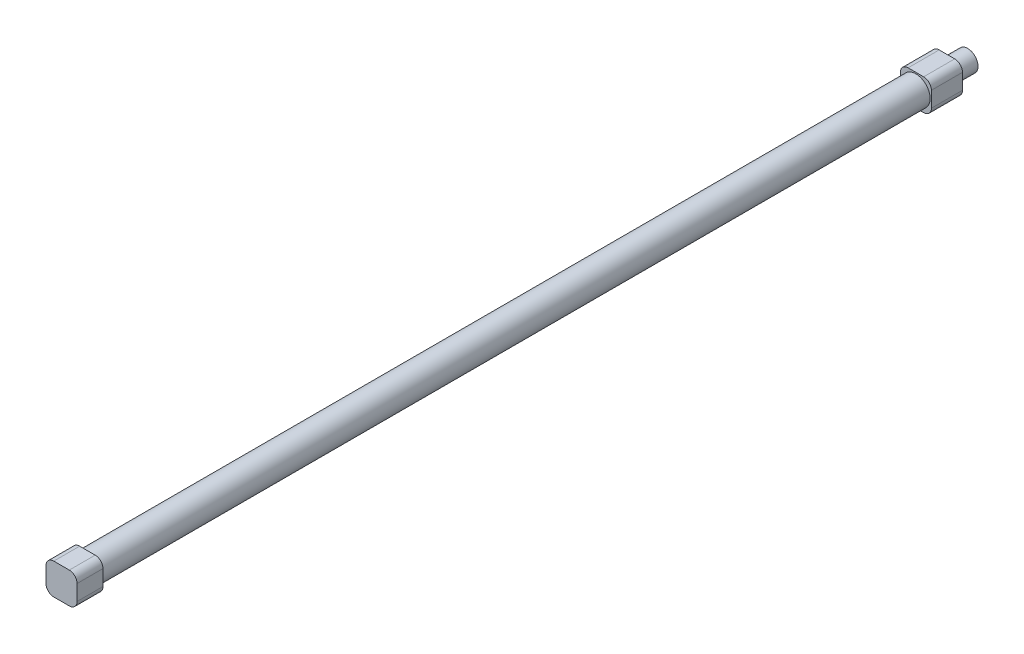
ISO-10303-21;
HEADER;
FILE_DESCRIPTION(('STEP AP214'),'2;1');
FILE_NAME('part.step','',(''),(''),'','','');
FILE_SCHEMA(('AUTOMOTIVE_DESIGN { 1 0 10303 214 1 1 1 1 }'));
ENDSEC;
DATA;
#1=APPLICATION_CONTEXT('core data for automotive mechanical design processes');
#2=APPLICATION_PROTOCOL_DEFINITION('international standard','automotive_design',2000,#1);
#3=PRODUCT_CONTEXT('',#1,'mechanical');
#4=PRODUCT('Part','Part','',(#3));
#5=PRODUCT_RELATED_PRODUCT_CATEGORY('part','',(#4));
#6=PRODUCT_DEFINITION_FORMATION('','',#4);
#7=PRODUCT_DEFINITION_CONTEXT('part definition',#1,'design');
#8=PRODUCT_DEFINITION('design','',#6,#7);
#9=PRODUCT_DEFINITION_SHAPE('','',#8);
#10=(LENGTH_UNIT() NAMED_UNIT(*) SI_UNIT(.MILLI.,.METRE.));
#11=(NAMED_UNIT(*) PLANE_ANGLE_UNIT() SI_UNIT($,.RADIAN.));
#12=(NAMED_UNIT(*) SI_UNIT($,.STERADIAN.) SOLID_ANGLE_UNIT());
#13=UNCERTAINTY_MEASURE_WITH_UNIT(LENGTH_MEASURE(1.E-05),#10,'distance_accuracy_value','');
#14=(GEOMETRIC_REPRESENTATION_CONTEXT(3) GLOBAL_UNCERTAINTY_ASSIGNED_CONTEXT((#13)) GLOBAL_UNIT_ASSIGNED_CONTEXT((#10,
#11,#12)) REPRESENTATION_CONTEXT('',''));
#15=CARTESIAN_POINT('',(0.,0.,0.));
#16=DIRECTION('',(0.,0.,1.));
#17=DIRECTION('',(1.,0.,0.));
#18=AXIS2_PLACEMENT_3D('',#15,#16,#17);
#19=CARTESIAN_POINT('',(3.,-3.,0.));
#20=DIRECTION('',(0.,0.,-1.));
#21=DIRECTION('',(-1.,0.,0.));
#22=AXIS2_PLACEMENT_3D('',#19,#20,#21);
#23=PLANE('',#22);
#24=CARTESIAN_POINT('',(0.,0.,0.));
#25=DIRECTION('',(0.,0.,-1.));
#26=DIRECTION('',(-1.,0.,0.));
#27=AXIS2_PLACEMENT_3D('',#24,#25,#26);
#28=CIRCLE('',#27,2.);
#29=CARTESIAN_POINT('',(-2.,0.,0.));
#30=VERTEX_POINT('',#29);
#31=EDGE_CURVE('E38',#30,#30,#28,.T.);
#32=ORIENTED_EDGE('',*,*,#31,.T.);
#33=EDGE_LOOP('',(#32));
#34=FACE_BOUND('',#33,.T.);
#35=CARTESIAN_POINT('',(0.,0.,0.));
#36=DIRECTION('',(0.,0.,1.));
#37=DIRECTION('',(1.,0.,0.));
#38=AXIS2_PLACEMENT_3D('',#35,#36,#37);
#39=CIRCLE('',#38,5.);
#40=CARTESIAN_POINT('',(5.,0.,0.));
#41=VERTEX_POINT('',#40);
#42=EDGE_CURVE('E44',#41,#41,#39,.T.);
#43=ORIENTED_EDGE('',*,*,#42,.T.);
#44=EDGE_LOOP('',(#43));
#45=FACE_BOUND('',#44,.T.);
#46=ADVANCED_FACE('F34',(#34,#45),#23,.F.);
#47=CARTESIAN_POINT('',(-3.,3.,320.));
#48=DIRECTION('',(0.,0.,1.));
#49=DIRECTION('',(1.,0.,0.));
#50=AXIS2_PLACEMENT_3D('',#47,#48,#49);
#51=PLANE('',#50);
#52=CARTESIAN_POINT('',(0.,0.,320.));
#53=DIRECTION('',(0.,0.,1.));
#54=DIRECTION('',(1.,0.,0.));
#55=AXIS2_PLACEMENT_3D('',#52,#53,#54);
#56=CIRCLE('',#55,5.);
#57=CARTESIAN_POINT('',(5.,0.,320.));
#58=VERTEX_POINT('',#57);
#59=EDGE_CURVE('E167',#58,#58,#56,.T.);
#60=ORIENTED_EDGE('',*,*,#59,.F.);
#61=EDGE_LOOP('',(#60));
#62=FACE_BOUND('',#61,.T.);
#63=ADVANCED_FACE('F177',(#62),#51,.F.);
#64=CARTESIAN_POINT('',(0.,0.,320.));
#65=DIRECTION('',(0.,0.,-1.));
#66=DIRECTION('',(-1.,0.,0.));
#67=AXIS2_PLACEMENT_3D('',#64,#65,#66);
#68=CYLINDRICAL_SURFACE('',#67,5.);
#69=ORIENTED_EDGE('',*,*,#59,.T.);
#70=EDGE_LOOP('',(#69));
#71=FACE_BOUND('',#70,.T.);
#72=ORIENTED_EDGE('',*,*,#42,.F.);
#73=EDGE_LOOP('',(#72));
#74=FACE_BOUND('',#73,.T.);
#75=ADVANCED_FACE('F174',(#71,#74),#68,.F.);
#76=CARTESIAN_POINT('',(0.,0.,18.));
#77=DIRECTION('',(0.,0.,-1.));
#78=DIRECTION('',(-1.,0.,0.));
#79=AXIS2_PLACEMENT_3D('',#76,#77,#78);
#80=CYLINDRICAL_SURFACE('',#79,2.);
#81=CARTESIAN_POINT('',(0.,0.,-20.));
#82=DIRECTION('',(0.,0.,-1.));
#83=DIRECTION('',(-1.,0.,0.));
#84=AXIS2_PLACEMENT_3D('',#81,#82,#83);
#85=CIRCLE('',#84,2.);
#86=CARTESIAN_POINT('',(-2.,0.,-20.));
#87=VERTEX_POINT('',#86);
#88=EDGE_CURVE('E327',#87,#87,#85,.T.);
#89=ORIENTED_EDGE('',*,*,#88,.T.);
#90=EDGE_LOOP('',(#89));
#91=FACE_BOUND('',#90,.T.);
#92=ORIENTED_EDGE('',*,*,#31,.F.);
#93=EDGE_LOOP('',(#92));
#94=FACE_BOUND('',#93,.T.);
#95=ADVANCED_FACE('F176',(#91,#94),#80,.F.);
#96=CARTESIAN_POINT('',(3.,-3.,-12.));
#97=DIRECTION('',(0.,0.,-1.));
#98=DIRECTION('',(-1.,0.,0.));
#99=AXIS2_PLACEMENT_3D('',#96,#97,#98);
#100=PLANE('',#99);
#101=CARTESIAN_POINT('',(3.,-3.,-12.));
#102=DIRECTION('',(0.,0.,-1.));
#103=DIRECTION('',(-1.,0.,0.));
#104=AXIS2_PLACEMENT_3D('',#101,#102,#103);
#105=CIRCLE('',#104,3.);
#106=CARTESIAN_POINT('',(6.,-2.99999999999998,-12.));
#107=VERTEX_POINT('',#106);
#108=CARTESIAN_POINT('',(2.99999999999998,-6.,-12.));
#109=VERTEX_POINT('',#108);
#110=EDGE_CURVE('E337',#107,#109,#105,.T.);
#111=ORIENTED_EDGE('',*,*,#110,.T.);
#112=DIRECTION('',(-1.,0.,0.));
#113=VECTOR('',#112,1.);
#114=CARTESIAN_POINT('',(2.99999999999998,-6.,-12.));
#115=LINE('',#114,#113);
#116=CARTESIAN_POINT('',(-2.99999999999998,-6.,-12.));
#117=VERTEX_POINT('',#116);
#118=EDGE_CURVE('E339',#109,#117,#115,.T.);
#119=ORIENTED_EDGE('',*,*,#118,.T.);
#120=CARTESIAN_POINT('',(-3.,-3.,-12.));
#121=DIRECTION('',(0.,0.,-1.));
#122=DIRECTION('',(-1.,0.,0.));
#123=AXIS2_PLACEMENT_3D('',#120,#121,#122);
#124=CIRCLE('',#123,3.);
#125=CARTESIAN_POINT('',(-6.,-2.99999999999998,-12.));
#126=VERTEX_POINT('',#125);
#127=EDGE_CURVE('E343',#117,#126,#124,.T.);
#128=ORIENTED_EDGE('',*,*,#127,.T.);
#129=DIRECTION('',(0.,1.,0.));
#130=VECTOR('',#129,1.);
#131=CARTESIAN_POINT('',(-6.,-2.99999999999998,-12.));
#132=LINE('',#131,#130);
#133=CARTESIAN_POINT('',(-6.,2.99999999999998,-12.));
#134=VERTEX_POINT('',#133);
#135=EDGE_CURVE('E346',#126,#134,#132,.T.);
#136=ORIENTED_EDGE('',*,*,#135,.T.);
#137=CARTESIAN_POINT('',(-3.,3.,-12.));
#138=DIRECTION('',(0.,0.,-1.));
#139=DIRECTION('',(-1.,0.,0.));
#140=AXIS2_PLACEMENT_3D('',#137,#138,#139);
#141=CIRCLE('',#140,3.);
#142=CARTESIAN_POINT('',(-2.99999999999998,6.,-12.));
#143=VERTEX_POINT('',#142);
#144=EDGE_CURVE('E349',#134,#143,#141,.T.);
#145=ORIENTED_EDGE('',*,*,#144,.T.);
#146=DIRECTION('',(1.,0.,0.));
#147=VECTOR('',#146,1.);
#148=CARTESIAN_POINT('',(2.99999999999998,6.,-12.));
#149=LINE('',#148,#147);
#150=CARTESIAN_POINT('',(2.99999999999998,6.,-12.));
#151=VERTEX_POINT('',#150);
#152=EDGE_CURVE('E352',#143,#151,#149,.T.);
#153=ORIENTED_EDGE('',*,*,#152,.T.);
#154=CARTESIAN_POINT('',(3.,3.,-12.));
#155=DIRECTION('',(0.,0.,-1.));
#156=DIRECTION('',(-1.,0.,0.));
#157=AXIS2_PLACEMENT_3D('',#154,#155,#156);
#158=CIRCLE('',#157,3.);
#159=CARTESIAN_POINT('',(6.,2.99999999999998,-12.));
#160=VERTEX_POINT('',#159);
#161=EDGE_CURVE('E355',#151,#160,#158,.T.);
#162=ORIENTED_EDGE('',*,*,#161,.T.);
#163=DIRECTION('',(0.,-1.,0.));
#164=VECTOR('',#163,1.);
#165=CARTESIAN_POINT('',(6.,-2.99999999999998,-12.));
#166=LINE('',#165,#164);
#167=EDGE_CURVE('E358',#160,#107,#166,.T.);
#168=ORIENTED_EDGE('',*,*,#167,.T.);
#169=EDGE_LOOP('',(#111,#119,#128,#136,#145,#153,#162,#168));
#170=FACE_BOUND('',#169,.T.);
#171=CARTESIAN_POINT('',(0.,0.,-12.));
#172=DIRECTION('',(0.,0.,-1.));
#173=DIRECTION('',(-1.,0.,0.));
#174=AXIS2_PLACEMENT_3D('',#171,#172,#173);
#175=CIRCLE('',#174,4.);
#176=CARTESIAN_POINT('',(-4.,0.,-12.));
#177=VERTEX_POINT('',#176);
#178=EDGE_CURVE('E334',#177,#177,#175,.T.);
#179=ORIENTED_EDGE('',*,*,#178,.F.);
#180=EDGE_LOOP('',(#179));
#181=FACE_BOUND('',#180,.T.);
#182=ADVANCED_FACE('F183',(#170,#181),#100,.T.);
#183=CARTESIAN_POINT('',(0.,0.,320.));
#184=DIRECTION('',(0.,0.,-1.));
#185=DIRECTION('',(-1.,0.,0.));
#186=AXIS2_PLACEMENT_3D('',#183,#184,#185);
#187=CYLINDRICAL_SURFACE('',#186,5.5);
#188=CARTESIAN_POINT('',(0.,0.,320.));
#189=DIRECTION('',(0.,0.,1.));
#190=DIRECTION('',(1.,0.,0.));
#191=AXIS2_PLACEMENT_3D('',#188,#189,#190);
#192=CIRCLE('',#191,5.5);
#193=CARTESIAN_POINT('',(5.5,0.,320.));
#194=VERTEX_POINT('',#193);
#195=EDGE_CURVE('E11',#194,#194,#192,.T.);
#196=ORIENTED_EDGE('',*,*,#195,.F.);
#197=EDGE_LOOP('',(#196));
#198=FACE_BOUND('',#197,.T.);
#199=CARTESIAN_POINT('',(0.,0.,0.));
#200=DIRECTION('',(0.,0.,-1.));
#201=DIRECTION('',(-1.,0.,0.));
#202=AXIS2_PLACEMENT_3D('',#199,#200,#201);
#203=CIRCLE('',#202,5.5);
#204=CARTESIAN_POINT('',(-5.5,0.,0.));
#205=VERTEX_POINT('',#204);
#206=EDGE_CURVE('E141',#205,#205,#203,.T.);
#207=ORIENTED_EDGE('',*,*,#206,.F.);
#208=EDGE_LOOP('',(#207));
#209=FACE_BOUND('',#208,.T.);
#210=ADVANCED_FACE('F36',(#198,#209),#187,.T.);
#211=CARTESIAN_POINT('',(-3.,3.,320.));
#212=DIRECTION('',(0.,0.,1.));
#213=DIRECTION('',(1.,0.,0.));
#214=AXIS2_PLACEMENT_3D('',#211,#212,#213);
#215=CIRCLE('',#214,3.);
#216=CARTESIAN_POINT('',(-3.,6.,320.));
#217=VERTEX_POINT('',#216);
#218=CARTESIAN_POINT('',(-6.,3.,320.));
#219=VERTEX_POINT('',#218);
#220=EDGE_CURVE('E137',#217,#219,#215,.T.);
#221=ORIENTED_EDGE('',*,*,#220,.F.);
#222=DIRECTION('',(-1.,0.,0.));
#223=VECTOR('',#222,1.);
#224=CARTESIAN_POINT('',(-3.,6.,320.));
#225=LINE('',#224,#223);
#226=CARTESIAN_POINT('',(3.,6.,320.));
#227=VERTEX_POINT('',#226);
#228=EDGE_CURVE('E88',#227,#217,#225,.T.);
#229=ORIENTED_EDGE('',*,*,#228,.F.);
#230=CARTESIAN_POINT('',(3.,3.,320.));
#231=DIRECTION('',(0.,0.,1.));
#232=DIRECTION('',(1.,0.,0.));
#233=AXIS2_PLACEMENT_3D('',#230,#231,#232);
#234=CIRCLE('',#233,3.);
#235=CARTESIAN_POINT('',(6.,3.,320.));
#236=VERTEX_POINT('',#235);
#237=EDGE_CURVE('E82',#236,#227,#234,.T.);
#238=ORIENTED_EDGE('',*,*,#237,.F.);
#239=DIRECTION('',(0.,1.,0.));
#240=VECTOR('',#239,1.);
#241=CARTESIAN_POINT('',(6.,-3.,320.));
#242=LINE('',#241,#240);
#243=CARTESIAN_POINT('',(6.,-3.,320.));
#244=VERTEX_POINT('',#243);
#245=EDGE_CURVE('E127',#244,#236,#242,.T.);
#246=ORIENTED_EDGE('',*,*,#245,.F.);
#247=CARTESIAN_POINT('',(3.,-3.,320.));
#248=DIRECTION('',(0.,0.,1.));
#249=DIRECTION('',(-1.,0.,0.));
#250=AXIS2_PLACEMENT_3D('',#247,#248,#249);
#251=CIRCLE('',#250,3.);
#252=CARTESIAN_POINT('',(3.,-6.,320.));
#253=VERTEX_POINT('',#252);
#254=EDGE_CURVE('E147',#253,#244,#251,.T.);
#255=ORIENTED_EDGE('',*,*,#254,.F.);
#256=DIRECTION('',(1.,0.,0.));
#257=VECTOR('',#256,1.);
#258=CARTESIAN_POINT('',(-3.,-6.,320.));
#259=LINE('',#258,#257);
#260=CARTESIAN_POINT('',(-3.,-6.,320.));
#261=VERTEX_POINT('',#260);
#262=EDGE_CURVE('E145',#261,#253,#259,.T.);
#263=ORIENTED_EDGE('',*,*,#262,.F.);
#264=CARTESIAN_POINT('',(-3.,-3.,320.));
#265=DIRECTION('',(0.,0.,1.));
#266=DIRECTION('',(1.,0.,0.));
#267=AXIS2_PLACEMENT_3D('',#264,#265,#266);
#268=CIRCLE('',#267,3.);
#269=CARTESIAN_POINT('',(-6.,-3.,320.));
#270=VERTEX_POINT('',#269);
#271=EDGE_CURVE('E143',#270,#261,#268,.T.);
#272=ORIENTED_EDGE('',*,*,#271,.F.);
#273=DIRECTION('',(0.,-1.,0.));
#274=VECTOR('',#273,1.);
#275=CARTESIAN_POINT('',(-6.,-3.,320.));
#276=LINE('',#275,#274);
#277=EDGE_CURVE('E140',#219,#270,#276,.T.);
#278=ORIENTED_EDGE('',*,*,#277,.F.);
#279=EDGE_LOOP('',(#221,#229,#238,#246,#255,#263,#272,#278));
#280=FACE_BOUND('',#279,.T.);
#281=ORIENTED_EDGE('',*,*,#195,.T.);
#282=EDGE_LOOP('',(#281));
#283=FACE_BOUND('',#282,.T.);
#284=ADVANCED_FACE('F188',(#280,#283),#51,.F.);
#285=CARTESIAN_POINT('',(-3.,3.,330.));
#286=DIRECTION('',(0.,0.,-1.));
#287=DIRECTION('',(-1.,0.,0.));
#288=AXIS2_PLACEMENT_3D('',#285,#286,#287);
#289=CYLINDRICAL_SURFACE('',#288,3.);
#290=ORIENTED_EDGE('',*,*,#220,.T.);
#291=DIRECTION('',(0.,0.,-1.));
#292=VECTOR('',#291,1.);
#293=CARTESIAN_POINT('',(-6.,3.,330.));
#294=LINE('',#293,#292);
#295=CARTESIAN_POINT('',(-6.,3.,330.));
#296=VERTEX_POINT('',#295);
#297=EDGE_CURVE('E165',#296,#219,#294,.T.);
#298=ORIENTED_EDGE('',*,*,#297,.F.);
#299=CARTESIAN_POINT('',(-3.,3.,330.));
#300=DIRECTION('',(0.,0.,1.));
#301=DIRECTION('',(1.,0.,0.));
#302=AXIS2_PLACEMENT_3D('',#299,#300,#301);
#303=CIRCLE('',#302,3.);
#304=CARTESIAN_POINT('',(-3.,6.,330.));
#305=VERTEX_POINT('',#304);
#306=EDGE_CURVE('E152',#305,#296,#303,.T.);
#307=ORIENTED_EDGE('',*,*,#306,.F.);
#308=DIRECTION('',(0.,0.,-1.));
#309=VECTOR('',#308,1.);
#310=CARTESIAN_POINT('',(-3.,6.,330.));
#311=LINE('',#310,#309);
#312=EDGE_CURVE('E133',#305,#217,#311,.T.);
#313=ORIENTED_EDGE('',*,*,#312,.T.);
#314=EDGE_LOOP('',(#290,#298,#307,#313));
#315=FACE_BOUND('',#314,.T.);
#316=ADVANCED_FACE('F248',(#315),#289,.T.);
#317=CARTESIAN_POINT('',(-6.,-3.,330.));
#318=DIRECTION('',(1.,0.,0.));
#319=DIRECTION('',(0.,0.,-1.));
#320=AXIS2_PLACEMENT_3D('',#317,#318,#319);
#321=PLANE('',#320);
#322=CARTESIAN_POINT('',(-6.,0.,324.));
#323=DIRECTION('',(-1.,0.,0.));
#324=DIRECTION('',(0.,0.,1.));
#325=AXIS2_PLACEMENT_3D('',#322,#323,#324);
#326=CIRCLE('',#325,2.);
#327=CARTESIAN_POINT('',(-6.,0.,326.));
#328=VERTEX_POINT('',#327);
#329=EDGE_CURVE('E318',#328,#328,#326,.T.);
#330=ORIENTED_EDGE('',*,*,#329,.F.);
#331=EDGE_LOOP('',(#330));
#332=FACE_BOUND('',#331,.T.);
#333=ORIENTED_EDGE('',*,*,#277,.T.);
#334=DIRECTION('',(0.,0.,-1.));
#335=VECTOR('',#334,1.);
#336=CARTESIAN_POINT('',(-6.,-3.,330.));
#337=LINE('',#336,#335);
#338=CARTESIAN_POINT('',(-6.,-3.,330.));
#339=VERTEX_POINT('',#338);
#340=EDGE_CURVE('E162',#339,#270,#337,.T.);
#341=ORIENTED_EDGE('',*,*,#340,.F.);
#342=DIRECTION('',(0.,-1.,0.));
#343=VECTOR('',#342,1.);
#344=CARTESIAN_POINT('',(-6.,-3.,330.));
#345=LINE('',#344,#343);
#346=EDGE_CURVE('E97',#296,#339,#345,.T.);
#347=ORIENTED_EDGE('',*,*,#346,.F.);
#348=ORIENTED_EDGE('',*,*,#297,.T.);
#349=EDGE_LOOP('',(#333,#341,#347,#348));
#350=FACE_BOUND('',#349,.T.);
#351=ADVANCED_FACE('F266',(#332,#350),#321,.F.);
#352=CARTESIAN_POINT('',(-3.,-3.,330.));
#353=DIRECTION('',(0.,0.,-1.));
#354=DIRECTION('',(-1.,0.,0.));
#355=AXIS2_PLACEMENT_3D('',#352,#353,#354);
#356=CYLINDRICAL_SURFACE('',#355,3.);
#357=ORIENTED_EDGE('',*,*,#271,.T.);
#358=DIRECTION('',(0.,0.,-1.));
#359=VECTOR('',#358,1.);
#360=CARTESIAN_POINT('',(-3.,-6.,330.));
#361=LINE('',#360,#359);
#362=CARTESIAN_POINT('',(-3.,-6.,330.));
#363=VERTEX_POINT('',#362);
#364=EDGE_CURVE('E159',#363,#261,#361,.T.);
#365=ORIENTED_EDGE('',*,*,#364,.F.);
#366=CARTESIAN_POINT('',(-3.,-3.,330.));
#367=DIRECTION('',(0.,0.,1.));
#368=DIRECTION('',(1.,0.,0.));
#369=AXIS2_PLACEMENT_3D('',#366,#367,#368);
#370=CIRCLE('',#369,3.);
#371=EDGE_CURVE('E229',#339,#363,#370,.T.);
#372=ORIENTED_EDGE('',*,*,#371,.F.);
#373=ORIENTED_EDGE('',*,*,#340,.T.);
#374=EDGE_LOOP('',(#357,#365,#372,#373));
#375=FACE_BOUND('',#374,.T.);
#376=ADVANCED_FACE('F263',(#375),#356,.T.);
#377=CARTESIAN_POINT('',(-3.,-6.,330.));
#378=DIRECTION('',(0.,1.,0.));
#379=DIRECTION('',(0.,0.,1.));
#380=AXIS2_PLACEMENT_3D('',#377,#378,#379);
#381=PLANE('',#380);
#382=ORIENTED_EDGE('',*,*,#262,.T.);
#383=DIRECTION('',(0.,0.,-1.));
#384=VECTOR('',#383,1.);
#385=CARTESIAN_POINT('',(3.,-6.,330.));
#386=LINE('',#385,#384);
#387=CARTESIAN_POINT('',(3.,-6.,330.));
#388=VERTEX_POINT('',#387);
#389=EDGE_CURVE('E156',#388,#253,#386,.T.);
#390=ORIENTED_EDGE('',*,*,#389,.F.);
#391=DIRECTION('',(1.,0.,0.));
#392=VECTOR('',#391,1.);
#393=CARTESIAN_POINT('',(-3.,-6.,330.));
#394=LINE('',#393,#392);
#395=EDGE_CURVE('E231',#363,#388,#394,.T.);
#396=ORIENTED_EDGE('',*,*,#395,.F.);
#397=ORIENTED_EDGE('',*,*,#364,.T.);
#398=EDGE_LOOP('',(#382,#390,#396,#397));
#399=FACE_BOUND('',#398,.T.);
#400=ADVANCED_FACE('F237',(#399),#381,.F.);
#401=CARTESIAN_POINT('',(3.,-3.,330.));
#402=DIRECTION('',(0.,0.,-1.));
#403=DIRECTION('',(-1.,0.,0.));
#404=AXIS2_PLACEMENT_3D('',#401,#402,#403);
#405=CYLINDRICAL_SURFACE('',#404,3.);
#406=ORIENTED_EDGE('',*,*,#254,.T.);
#407=DIRECTION('',(0.,0.,-1.));
#408=VECTOR('',#407,1.);
#409=CARTESIAN_POINT('',(6.,-3.,330.));
#410=LINE('',#409,#408);
#411=CARTESIAN_POINT('',(6.,-3.,330.));
#412=VERTEX_POINT('',#411);
#413=EDGE_CURVE('E128',#412,#244,#410,.T.);
#414=ORIENTED_EDGE('',*,*,#413,.F.);
#415=CARTESIAN_POINT('',(3.,-3.,330.));
#416=DIRECTION('',(0.,0.,1.));
#417=DIRECTION('',(-1.,0.,0.));
#418=AXIS2_PLACEMENT_3D('',#415,#416,#417);
#419=CIRCLE('',#418,3.);
#420=EDGE_CURVE('E119',#388,#412,#419,.T.);
#421=ORIENTED_EDGE('',*,*,#420,.F.);
#422=ORIENTED_EDGE('',*,*,#389,.T.);
#423=EDGE_LOOP('',(#406,#414,#421,#422));
#424=FACE_BOUND('',#423,.T.);
#425=ADVANCED_FACE('F241',(#424),#405,.T.);
#426=CARTESIAN_POINT('',(6.,-3.,330.));
#427=DIRECTION('',(-1.,0.,0.));
#428=DIRECTION('',(0.,-1.,0.));
#429=AXIS2_PLACEMENT_3D('',#426,#427,#428);
#430=PLANE('',#429);
#431=ORIENTED_EDGE('',*,*,#245,.T.);
#432=DIRECTION('',(0.,0.,-1.));
#433=VECTOR('',#432,1.);
#434=CARTESIAN_POINT('',(6.,3.,330.));
#435=LINE('',#434,#433);
#436=CARTESIAN_POINT('',(6.,3.,330.));
#437=VERTEX_POINT('',#436);
#438=EDGE_CURVE('E124',#437,#236,#435,.T.);
#439=ORIENTED_EDGE('',*,*,#438,.F.);
#440=DIRECTION('',(0.,1.,0.));
#441=VECTOR('',#440,1.);
#442=CARTESIAN_POINT('',(6.,-3.,330.));
#443=LINE('',#442,#441);
#444=EDGE_CURVE('E113',#412,#437,#443,.T.);
#445=ORIENTED_EDGE('',*,*,#444,.F.);
#446=ORIENTED_EDGE('',*,*,#413,.T.);
#447=EDGE_LOOP('',(#431,#439,#445,#446));
#448=FACE_BOUND('',#447,.T.);
#449=ADVANCED_FACE('F125',(#448),#430,.F.);
#450=CARTESIAN_POINT('',(3.,3.,330.));
#451=DIRECTION('',(0.,0.,-1.));
#452=DIRECTION('',(-1.,0.,0.));
#453=AXIS2_PLACEMENT_3D('',#450,#451,#452);
#454=CYLINDRICAL_SURFACE('',#453,3.);
#455=ORIENTED_EDGE('',*,*,#237,.T.);
#456=DIRECTION('',(0.,0.,-1.));
#457=VECTOR('',#456,1.);
#458=CARTESIAN_POINT('',(3.,6.,330.));
#459=LINE('',#458,#457);
#460=CARTESIAN_POINT('',(3.,6.,330.));
#461=VERTEX_POINT('',#460);
#462=EDGE_CURVE('E129',#461,#227,#459,.T.);
#463=ORIENTED_EDGE('',*,*,#462,.F.);
#464=CARTESIAN_POINT('',(3.,3.,330.));
#465=DIRECTION('',(0.,0.,1.));
#466=DIRECTION('',(1.,0.,0.));
#467=AXIS2_PLACEMENT_3D('',#464,#465,#466);
#468=CIRCLE('',#467,3.);
#469=EDGE_CURVE('E117',#437,#461,#468,.T.);
#470=ORIENTED_EDGE('',*,*,#469,.F.);
#471=ORIENTED_EDGE('',*,*,#438,.T.);
#472=EDGE_LOOP('',(#455,#463,#470,#471));
#473=FACE_BOUND('',#472,.T.);
#474=ADVANCED_FACE('F131',(#473),#454,.T.);
#475=CARTESIAN_POINT('',(-3.,6.,330.));
#476=DIRECTION('',(0.,-1.,0.));
#477=DIRECTION('',(0.,0.,-1.));
#478=AXIS2_PLACEMENT_3D('',#475,#476,#477);
#479=PLANE('',#478);
#480=ORIENTED_EDGE('',*,*,#228,.T.);
#481=ORIENTED_EDGE('',*,*,#312,.F.);
#482=DIRECTION('',(-1.,0.,0.));
#483=VECTOR('',#482,1.);
#484=CARTESIAN_POINT('',(-3.,6.,330.));
#485=LINE('',#484,#483);
#486=EDGE_CURVE('E52',#461,#305,#485,.T.);
#487=ORIENTED_EDGE('',*,*,#486,.F.);
#488=ORIENTED_EDGE('',*,*,#462,.T.);
#489=EDGE_LOOP('',(#480,#481,#487,#488));
#490=FACE_BOUND('',#489,.T.);
#491=ADVANCED_FACE('F209',(#490),#479,.F.);
#492=CARTESIAN_POINT('',(-3.,3.,330.));
#493=DIRECTION('',(0.,0.,1.));
#494=DIRECTION('',(1.,0.,0.));
#495=AXIS2_PLACEMENT_3D('',#492,#493,#494);
#496=PLANE('',#495);
#497=ORIENTED_EDGE('',*,*,#306,.T.);
#498=ORIENTED_EDGE('',*,*,#346,.T.);
#499=ORIENTED_EDGE('',*,*,#371,.T.);
#500=ORIENTED_EDGE('',*,*,#395,.T.);
#501=ORIENTED_EDGE('',*,*,#420,.T.);
#502=ORIENTED_EDGE('',*,*,#444,.T.);
#503=ORIENTED_EDGE('',*,*,#469,.T.);
#504=ORIENTED_EDGE('',*,*,#486,.T.);
#505=EDGE_LOOP('',(#497,#498,#499,#500,#501,#502,#503,#504));
#506=FACE_BOUND('',#505,.T.);
#507=ADVANCED_FACE('F115',(#506),#496,.T.);
#508=CARTESIAN_POINT('',(3.,-3.,0.));
#509=DIRECTION('',(0.,0.,-1.));
#510=DIRECTION('',(-1.,0.,0.));
#511=AXIS2_PLACEMENT_3D('',#508,#509,#510);
#512=CIRCLE('',#511,3.);
#513=CARTESIAN_POINT('',(6.,-2.99999999999998,0.));
#514=VERTEX_POINT('',#513);
#515=CARTESIAN_POINT('',(2.99999999999998,-6.,0.));
#516=VERTEX_POINT('',#515);
#517=EDGE_CURVE('E216',#514,#516,#512,.T.);
#518=ORIENTED_EDGE('',*,*,#517,.F.);
#519=DIRECTION('',(0.,-1.,0.));
#520=VECTOR('',#519,1.);
#521=CARTESIAN_POINT('',(6.,-2.99999999999998,0.));
#522=LINE('',#521,#520);
#523=CARTESIAN_POINT('',(6.,2.99999999999998,0.));
#524=VERTEX_POINT('',#523);
#525=EDGE_CURVE('E340',#524,#514,#522,.T.);
#526=ORIENTED_EDGE('',*,*,#525,.F.);
#527=CARTESIAN_POINT('',(3.,3.,0.));
#528=DIRECTION('',(0.,0.,-1.));
#529=DIRECTION('',(-1.,0.,0.));
#530=AXIS2_PLACEMENT_3D('',#527,#528,#529);
#531=CIRCLE('',#530,3.);
#532=CARTESIAN_POINT('',(2.99999999999998,6.,0.));
#533=VERTEX_POINT('',#532);
#534=EDGE_CURVE('E378',#533,#524,#531,.T.);
#535=ORIENTED_EDGE('',*,*,#534,.F.);
#536=DIRECTION('',(1.,0.,0.));
#537=VECTOR('',#536,1.);
#538=CARTESIAN_POINT('',(2.99999999999998,6.,0.));
#539=LINE('',#538,#537);
#540=CARTESIAN_POINT('',(-2.99999999999998,6.,0.));
#541=VERTEX_POINT('',#540);
#542=EDGE_CURVE('E375',#541,#533,#539,.T.);
#543=ORIENTED_EDGE('',*,*,#542,.F.);
#544=CARTESIAN_POINT('',(-3.,3.,0.));
#545=DIRECTION('',(0.,0.,-1.));
#546=DIRECTION('',(-1.,0.,0.));
#547=AXIS2_PLACEMENT_3D('',#544,#545,#546);
#548=CIRCLE('',#547,3.);
#549=CARTESIAN_POINT('',(-6.,2.99999999999998,0.));
#550=VERTEX_POINT('',#549);
#551=EDGE_CURVE('E372',#550,#541,#548,.T.);
#552=ORIENTED_EDGE('',*,*,#551,.F.);
#553=DIRECTION('',(0.,1.,0.));
#554=VECTOR('',#553,1.);
#555=CARTESIAN_POINT('',(-6.,-2.99999999999998,0.));
#556=LINE('',#555,#554);
#557=CARTESIAN_POINT('',(-6.,-2.99999999999998,0.));
#558=VERTEX_POINT('',#557);
#559=EDGE_CURVE('E369',#558,#550,#556,.T.);
#560=ORIENTED_EDGE('',*,*,#559,.F.);
#561=CARTESIAN_POINT('',(-3.,-3.,0.));
#562=DIRECTION('',(0.,0.,-1.));
#563=DIRECTION('',(-1.,0.,0.));
#564=AXIS2_PLACEMENT_3D('',#561,#562,#563);
#565=CIRCLE('',#564,3.);
#566=CARTESIAN_POINT('',(-2.99999999999998,-6.,0.));
#567=VERTEX_POINT('',#566);
#568=EDGE_CURVE('E366',#567,#558,#565,.T.);
#569=ORIENTED_EDGE('',*,*,#568,.F.);
#570=DIRECTION('',(-1.,0.,0.));
#571=VECTOR('',#570,1.);
#572=CARTESIAN_POINT('',(2.99999999999998,-6.,0.));
#573=LINE('',#572,#571);
#574=EDGE_CURVE('E363',#516,#567,#573,.T.);
#575=ORIENTED_EDGE('',*,*,#574,.F.);
#576=EDGE_LOOP('',(#518,#526,#535,#543,#552,#560,#569,#575));
#577=FACE_BOUND('',#576,.T.);
#578=ORIENTED_EDGE('',*,*,#206,.T.);
#579=EDGE_LOOP('',(#578));
#580=FACE_BOUND('',#579,.T.);
#581=ADVANCED_FACE('F193',(#577,#580),#23,.F.);
#582=CARTESIAN_POINT('',(3.,-3.,-12.));
#583=DIRECTION('',(0.,0.,1.));
#584=DIRECTION('',(1.,0.,0.));
#585=AXIS2_PLACEMENT_3D('',#582,#583,#584);
#586=CYLINDRICAL_SURFACE('',#585,3.);
#587=ORIENTED_EDGE('',*,*,#517,.T.);
#588=DIRECTION('',(0.,0.,1.));
#589=VECTOR('',#588,1.);
#590=CARTESIAN_POINT('',(2.99999999999998,-6.,-12.));
#591=LINE('',#590,#589);
#592=EDGE_CURVE('E220',#109,#516,#591,.T.);
#593=ORIENTED_EDGE('',*,*,#592,.F.);
#594=ORIENTED_EDGE('',*,*,#110,.F.);
#595=DIRECTION('',(0.,0.,1.));
#596=VECTOR('',#595,1.);
#597=CARTESIAN_POINT('',(6.,-2.99999999999998,-12.));
#598=LINE('',#597,#596);
#599=EDGE_CURVE('E361',#107,#514,#598,.T.);
#600=ORIENTED_EDGE('',*,*,#599,.T.);
#601=EDGE_LOOP('',(#587,#593,#594,#600));
#602=FACE_BOUND('',#601,.T.);
#603=ADVANCED_FACE('F200',(#602),#586,.T.);
#604=CARTESIAN_POINT('',(2.99999999999998,-6.,-12.));
#605=DIRECTION('',(0.,1.,0.));
#606=DIRECTION('',(0.,0.,1.));
#607=AXIS2_PLACEMENT_3D('',#604,#605,#606);
#608=PLANE('',#607);
#609=ORIENTED_EDGE('',*,*,#574,.T.);
#610=DIRECTION('',(0.,0.,1.));
#611=VECTOR('',#610,1.);
#612=CARTESIAN_POINT('',(-2.99999999999998,-6.,-12.));
#613=LINE('',#612,#611);
#614=EDGE_CURVE('E223',#117,#567,#613,.T.);
#615=ORIENTED_EDGE('',*,*,#614,.F.);
#616=ORIENTED_EDGE('',*,*,#118,.F.);
#617=ORIENTED_EDGE('',*,*,#592,.T.);
#618=EDGE_LOOP('',(#609,#615,#616,#617));
#619=FACE_BOUND('',#618,.T.);
#620=ADVANCED_FACE('F206',(#619),#608,.F.);
#621=CARTESIAN_POINT('',(-3.,-3.,-12.));
#622=DIRECTION('',(0.,0.,1.));
#623=DIRECTION('',(1.,0.,0.));
#624=AXIS2_PLACEMENT_3D('',#621,#622,#623);
#625=CYLINDRICAL_SURFACE('',#624,3.);
#626=ORIENTED_EDGE('',*,*,#568,.T.);
#627=DIRECTION('',(0.,0.,1.));
#628=VECTOR('',#627,1.);
#629=CARTESIAN_POINT('',(-6.,-2.99999999999998,-12.));
#630=LINE('',#629,#628);
#631=EDGE_CURVE('E397',#126,#558,#630,.T.);
#632=ORIENTED_EDGE('',*,*,#631,.F.);
#633=ORIENTED_EDGE('',*,*,#127,.F.);
#634=ORIENTED_EDGE('',*,*,#614,.T.);
#635=EDGE_LOOP('',(#626,#632,#633,#634));
#636=FACE_BOUND('',#635,.T.);
#637=ADVANCED_FACE('F405',(#636),#625,.T.);
#638=CARTESIAN_POINT('',(-6.,-2.99999999999998,-12.));
#639=DIRECTION('',(1.,0.,0.));
#640=DIRECTION('',(0.,0.,-1.));
#641=AXIS2_PLACEMENT_3D('',#638,#639,#640);
#642=PLANE('',#641);
#643=CARTESIAN_POINT('',(-6.,0.,-4.));
#644=DIRECTION('',(-1.,0.,0.));
#645=DIRECTION('',(0.,0.,1.));
#646=AXIS2_PLACEMENT_3D('',#643,#644,#645);
#647=CIRCLE('',#646,2.);
#648=CARTESIAN_POINT('',(-6.,0.,-2.));
#649=VERTEX_POINT('',#648);
#650=EDGE_CURVE('E317',#649,#649,#647,.T.);
#651=ORIENTED_EDGE('',*,*,#650,.F.);
#652=EDGE_LOOP('',(#651));
#653=FACE_BOUND('',#652,.T.);
#654=ORIENTED_EDGE('',*,*,#559,.T.);
#655=DIRECTION('',(0.,0.,1.));
#656=VECTOR('',#655,1.);
#657=CARTESIAN_POINT('',(-6.,2.99999999999998,-12.));
#658=LINE('',#657,#656);
#659=EDGE_CURVE('E394',#134,#550,#658,.T.);
#660=ORIENTED_EDGE('',*,*,#659,.F.);
#661=ORIENTED_EDGE('',*,*,#135,.F.);
#662=ORIENTED_EDGE('',*,*,#631,.T.);
#663=EDGE_LOOP('',(#654,#660,#661,#662));
#664=FACE_BOUND('',#663,.T.);
#665=ADVANCED_FACE('F420',(#653,#664),#642,.F.);
#666=CARTESIAN_POINT('',(-3.,3.,-12.));
#667=DIRECTION('',(0.,0.,1.));
#668=DIRECTION('',(1.,0.,0.));
#669=AXIS2_PLACEMENT_3D('',#666,#667,#668);
#670=CYLINDRICAL_SURFACE('',#669,3.);
#671=ORIENTED_EDGE('',*,*,#551,.T.);
#672=DIRECTION('',(0.,0.,1.));
#673=VECTOR('',#672,1.);
#674=CARTESIAN_POINT('',(-2.99999999999998,6.,-12.));
#675=LINE('',#674,#673);
#676=EDGE_CURVE('E391',#143,#541,#675,.T.);
#677=ORIENTED_EDGE('',*,*,#676,.F.);
#678=ORIENTED_EDGE('',*,*,#144,.F.);
#679=ORIENTED_EDGE('',*,*,#659,.T.);
#680=EDGE_LOOP('',(#671,#677,#678,#679));
#681=FACE_BOUND('',#680,.T.);
#682=ADVANCED_FACE('F427',(#681),#670,.T.);
#683=CARTESIAN_POINT('',(2.99999999999998,6.,-12.));
#684=DIRECTION('',(0.,-1.,0.));
#685=DIRECTION('',(0.,0.,-1.));
#686=AXIS2_PLACEMENT_3D('',#683,#684,#685);
#687=PLANE('',#686);
#688=ORIENTED_EDGE('',*,*,#542,.T.);
#689=DIRECTION('',(0.,0.,1.));
#690=VECTOR('',#689,1.);
#691=CARTESIAN_POINT('',(2.99999999999998,6.,-12.));
#692=LINE('',#691,#690);
#693=EDGE_CURVE('E388',#151,#533,#692,.T.);
#694=ORIENTED_EDGE('',*,*,#693,.F.);
#695=ORIENTED_EDGE('',*,*,#152,.F.);
#696=ORIENTED_EDGE('',*,*,#676,.T.);
#697=EDGE_LOOP('',(#688,#694,#695,#696));
#698=FACE_BOUND('',#697,.T.);
#699=ADVANCED_FACE('F469',(#698),#687,.F.);
#700=CARTESIAN_POINT('',(3.,3.,-12.));
#701=DIRECTION('',(0.,0.,1.));
#702=DIRECTION('',(1.,0.,0.));
#703=AXIS2_PLACEMENT_3D('',#700,#701,#702);
#704=CYLINDRICAL_SURFACE('',#703,3.);
#705=ORIENTED_EDGE('',*,*,#534,.T.);
#706=DIRECTION('',(0.,0.,1.));
#707=VECTOR('',#706,1.);
#708=CARTESIAN_POINT('',(6.,2.99999999999998,-12.));
#709=LINE('',#708,#707);
#710=EDGE_CURVE('E385',#160,#524,#709,.T.);
#711=ORIENTED_EDGE('',*,*,#710,.F.);
#712=ORIENTED_EDGE('',*,*,#161,.F.);
#713=ORIENTED_EDGE('',*,*,#693,.T.);
#714=EDGE_LOOP('',(#705,#711,#712,#713));
#715=FACE_BOUND('',#714,.T.);
#716=ADVANCED_FACE('F472',(#715),#704,.T.);
#717=CARTESIAN_POINT('',(6.,-2.99999999999998,-12.));
#718=DIRECTION('',(-1.,0.,0.));
#719=DIRECTION('',(0.,0.,1.));
#720=AXIS2_PLACEMENT_3D('',#717,#718,#719);
#721=PLANE('',#720);
#722=ORIENTED_EDGE('',*,*,#525,.T.);
#723=ORIENTED_EDGE('',*,*,#599,.F.);
#724=ORIENTED_EDGE('',*,*,#167,.F.);
#725=ORIENTED_EDGE('',*,*,#710,.T.);
#726=EDGE_LOOP('',(#722,#723,#724,#725));
#727=FACE_BOUND('',#726,.T.);
#728=ADVANCED_FACE('F292',(#727),#721,.F.);
#729=CARTESIAN_POINT('',(0.,0.,-20.));
#730=DIRECTION('',(0.,0.,1.));
#731=DIRECTION('',(1.,0.,0.));
#732=AXIS2_PLACEMENT_3D('',#729,#730,#731);
#733=CYLINDRICAL_SURFACE('',#732,4.);
#734=CARTESIAN_POINT('',(0.,0.,-20.));
#735=DIRECTION('',(0.,0.,-1.));
#736=DIRECTION('',(-1.,0.,0.));
#737=AXIS2_PLACEMENT_3D('',#734,#735,#736);
#738=CIRCLE('',#737,4.);
#739=CARTESIAN_POINT('',(-4.,0.,-20.));
#740=VERTEX_POINT('',#739);
#741=EDGE_CURVE('E331',#740,#740,#738,.T.);
#742=ORIENTED_EDGE('',*,*,#741,.F.);
#743=EDGE_LOOP('',(#742));
#744=FACE_BOUND('',#743,.T.);
#745=ORIENTED_EDGE('',*,*,#178,.T.);
#746=EDGE_LOOP('',(#745));
#747=FACE_BOUND('',#746,.T.);
#748=ADVANCED_FACE('F288',(#744,#747),#733,.T.);
#749=CARTESIAN_POINT('',(0.,0.,-20.));
#750=DIRECTION('',(0.,0.,-1.));
#751=DIRECTION('',(-1.,0.,0.));
#752=AXIS2_PLACEMENT_3D('',#749,#750,#751);
#753=PLANE('',#752);
#754=ORIENTED_EDGE('',*,*,#88,.F.);
#755=EDGE_LOOP('',(#754));
#756=FACE_BOUND('',#755,.T.);
#757=ORIENTED_EDGE('',*,*,#741,.T.);
#758=EDGE_LOOP('',(#757));
#759=FACE_BOUND('',#758,.T.);
#760=ADVANCED_FACE('F291',(#756,#759),#753,.T.);
#761=CARTESIAN_POINT('',(-3.,0.,-4.));
#762=DIRECTION('',(-1.,0.,0.));
#763=DIRECTION('',(0.,0.,1.));
#764=AXIS2_PLACEMENT_3D('',#761,#762,#763);
#765=CYLINDRICAL_SURFACE('',#764,2.);
#766=CARTESIAN_POINT('',(-3.,0.,-4.));
#767=DIRECTION('',(-1.,0.,0.));
#768=DIRECTION('',(0.,0.,1.));
#769=AXIS2_PLACEMENT_3D('',#766,#767,#768);
#770=CIRCLE('',#769,2.);
#771=CARTESIAN_POINT('',(-3.,0.,-2.));
#772=VERTEX_POINT('',#771);
#773=EDGE_CURVE('E321',#772,#772,#770,.T.);
#774=ORIENTED_EDGE('',*,*,#773,.F.);
#775=EDGE_LOOP('',(#774));
#776=FACE_BOUND('',#775,.T.);
#777=ORIENTED_EDGE('',*,*,#650,.T.);
#778=EDGE_LOOP('',(#777));
#779=FACE_BOUND('',#778,.T.);
#780=ADVANCED_FACE('F295',(#776,#779),#765,.F.);
#781=CARTESIAN_POINT('',(-3.,0.,-4.));
#782=DIRECTION('',(-1.,0.,0.));
#783=DIRECTION('',(0.,0.,1.));
#784=AXIS2_PLACEMENT_3D('',#781,#782,#783);
#785=PLANE('',#784);
#786=ORIENTED_EDGE('',*,*,#773,.T.);
#787=EDGE_LOOP('',(#786));
#788=FACE_BOUND('',#787,.T.);
#789=ADVANCED_FACE('F300',(#788),#785,.T.);
#790=CARTESIAN_POINT('',(-3.,0.,324.));
#791=DIRECTION('',(-1.,0.,0.));
#792=DIRECTION('',(0.,0.,1.));
#793=AXIS2_PLACEMENT_3D('',#790,#791,#792);
#794=CYLINDRICAL_SURFACE('',#793,2.);
#795=CARTESIAN_POINT('',(-3.,0.,324.));
#796=DIRECTION('',(-1.,0.,0.));
#797=DIRECTION('',(0.,0.,1.));
#798=AXIS2_PLACEMENT_3D('',#795,#796,#797);
#799=CIRCLE('',#798,2.);
#800=CARTESIAN_POINT('',(-3.,0.,326.));
#801=VERTEX_POINT('',#800);
#802=EDGE_CURVE('E316',#801,#801,#799,.T.);
#803=ORIENTED_EDGE('',*,*,#802,.F.);
#804=EDGE_LOOP('',(#803));
#805=FACE_BOUND('',#804,.T.);
#806=ORIENTED_EDGE('',*,*,#329,.T.);
#807=EDGE_LOOP('',(#806));
#808=FACE_BOUND('',#807,.T.);
#809=ADVANCED_FACE('F304',(#805,#808),#794,.F.);
#810=CARTESIAN_POINT('',(-3.,0.,324.));
#811=DIRECTION('',(-1.,0.,0.));
#812=DIRECTION('',(0.,0.,1.));
#813=AXIS2_PLACEMENT_3D('',#810,#811,#812);
#814=PLANE('',#813);
#815=ORIENTED_EDGE('',*,*,#802,.T.);
#816=EDGE_LOOP('',(#815));
#817=FACE_BOUND('',#816,.T.);
#818=ADVANCED_FACE('F308',(#817),#814,.T.);
#819=CLOSED_SHELL('',(#46,#63,#75,#95,#182,#210,#284,#316,#351,#376,#400,#425,#449,#474,#491,
#507,#581,#603,#620,#637,#665,#682,#699,#716,#728,#748,#760,#780,#789,#809,#818));
#820=MANIFOLD_SOLID_BREP('B2',#819);
#821=ADVANCED_BREP_SHAPE_REPRESENTATION('',(#18,#820),#14);
#822=SHAPE_DEFINITION_REPRESENTATION(#9,#821);
ENDSEC;
END-ISO-10303-21;
